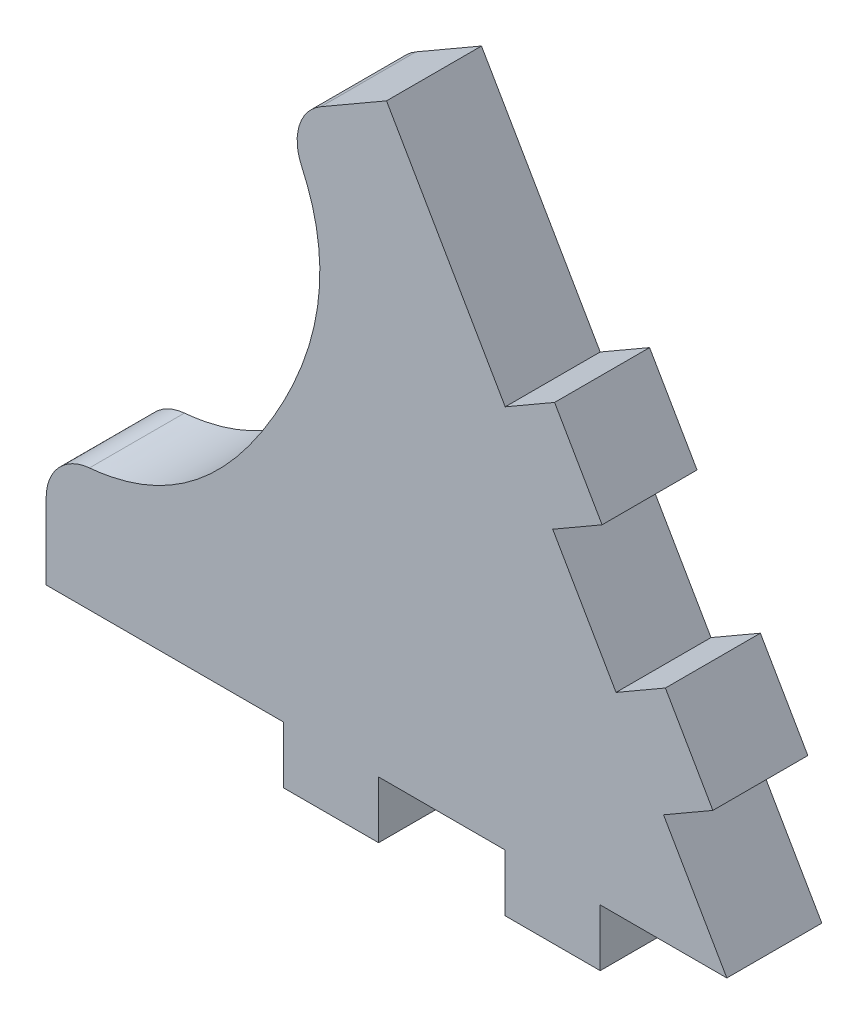
ISO-10303-21;
HEADER;
FILE_DESCRIPTION(('STEP AP214'),'2;1');
FILE_NAME('part.step','',(''),(''),'','','');
FILE_SCHEMA(('AUTOMOTIVE_DESIGN { 1 0 10303 214 1 1 1 1 }'));
ENDSEC;
DATA;
#1=APPLICATION_CONTEXT('core data for automotive mechanical design processes');
#2=APPLICATION_PROTOCOL_DEFINITION('international standard','automotive_design',2000,#1);
#3=PRODUCT_CONTEXT('',#1,'mechanical');
#4=PRODUCT('Part','Part','',(#3));
#5=PRODUCT_RELATED_PRODUCT_CATEGORY('part','',(#4));
#6=PRODUCT_DEFINITION_FORMATION('','',#4);
#7=PRODUCT_DEFINITION_CONTEXT('part definition',#1,'design');
#8=PRODUCT_DEFINITION('design','',#6,#7);
#9=PRODUCT_DEFINITION_SHAPE('','',#8);
#10=(LENGTH_UNIT() NAMED_UNIT(*) SI_UNIT(.MILLI.,.METRE.));
#11=(NAMED_UNIT(*) PLANE_ANGLE_UNIT() SI_UNIT($,.RADIAN.));
#12=(NAMED_UNIT(*) SI_UNIT($,.STERADIAN.) SOLID_ANGLE_UNIT());
#13=UNCERTAINTY_MEASURE_WITH_UNIT(LENGTH_MEASURE(1.E-05),#10,'distance_accuracy_value','');
#14=(GEOMETRIC_REPRESENTATION_CONTEXT(3) GLOBAL_UNCERTAINTY_ASSIGNED_CONTEXT((#13)) GLOBAL_UNIT_ASSIGNED_CONTEXT((#10,
#11,#12)) REPRESENTATION_CONTEXT('',''));
#15=CARTESIAN_POINT('',(0.,0.,0.));
#16=DIRECTION('',(0.,0.,1.));
#17=DIRECTION('',(1.,0.,0.));
#18=AXIS2_PLACEMENT_3D('',#15,#16,#17);
#19=CARTESIAN_POINT('',(46.66666666,-5.99999999999635,10.));
#20=DIRECTION('',(0.,1.,0.));
#21=DIRECTION('',(0.,0.,1.));
#22=AXIS2_PLACEMENT_3D('',#19,#20,#21);
#23=PLANE('',#22);
#24=DIRECTION('',(1.,0.,0.));
#25=VECTOR('',#24,1.);
#26=CARTESIAN_POINT('',(46.66666666,-5.99999999999635,0.));
#27=LINE('',#26,#25);
#28=CARTESIAN_POINT('',(36.66666666,-5.99999999999635,0.));
#29=VERTEX_POINT('',#28);
#30=CARTESIAN_POINT('',(46.66666666,-5.99999999999635,0.));
#31=VERTEX_POINT('',#30);
#32=EDGE_CURVE('E216',#29,#31,#27,.T.);
#33=ORIENTED_EDGE('',*,*,#32,.T.);
#34=DIRECTION('',(0.,0.,-1.));
#35=VECTOR('',#34,1.);
#36=CARTESIAN_POINT('',(46.66666666,-5.99999999999635,10.));
#37=LINE('',#36,#35);
#38=CARTESIAN_POINT('',(46.66666666,-5.99999999999635,10.));
#39=VERTEX_POINT('',#38);
#40=EDGE_CURVE('E197',#39,#31,#37,.T.);
#41=ORIENTED_EDGE('',*,*,#40,.F.);
#42=DIRECTION('',(1.,0.,0.));
#43=VECTOR('',#42,1.);
#44=CARTESIAN_POINT('',(46.66666666,-5.99999999999635,10.));
#45=LINE('',#44,#43);
#46=CARTESIAN_POINT('',(36.66666666,-5.99999999999635,10.));
#47=VERTEX_POINT('',#46);
#48=EDGE_CURVE('E203',#47,#39,#45,.T.);
#49=ORIENTED_EDGE('',*,*,#48,.F.);
#50=DIRECTION('',(0.,0.,-1.));
#51=VECTOR('',#50,1.);
#52=CARTESIAN_POINT('',(36.66666666,-5.99999999999635,10.));
#53=LINE('',#52,#51);
#54=EDGE_CURVE('E280',#47,#29,#53,.T.);
#55=ORIENTED_EDGE('',*,*,#54,.T.);
#56=EDGE_LOOP('',(#33,#41,#49,#55));
#57=FACE_BOUND('',#56,.T.);
#58=ADVANCED_FACE('F32',(#57),#23,.F.);
#59=CARTESIAN_POINT('',(46.66666666,3.64118457607532E-12,10.));
#60=DIRECTION('',(-1.,0.,0.));
#61=DIRECTION('',(0.,-1.,0.));
#62=AXIS2_PLACEMENT_3D('',#59,#60,#61);
#63=PLANE('',#62);
#64=DIRECTION('',(0.,1.,0.));
#65=VECTOR('',#64,1.);
#66=CARTESIAN_POINT('',(46.66666666,3.64118457607532E-12,0.));
#67=LINE('',#66,#65);
#68=CARTESIAN_POINT('',(46.66666666,3.64118457607532E-12,0.));
#69=VERTEX_POINT('',#68);
#70=EDGE_CURVE('E346',#31,#69,#67,.T.);
#71=ORIENTED_EDGE('',*,*,#70,.T.);
#72=DIRECTION('',(0.,0.,-1.));
#73=VECTOR('',#72,1.);
#74=CARTESIAN_POINT('',(46.66666666,3.64118457607532E-12,10.));
#75=LINE('',#74,#73);
#76=CARTESIAN_POINT('',(46.66666666,3.64118457607532E-12,10.));
#77=VERTEX_POINT('',#76);
#78=EDGE_CURVE('E200',#77,#69,#75,.T.);
#79=ORIENTED_EDGE('',*,*,#78,.F.);
#80=DIRECTION('',(0.,1.,0.));
#81=VECTOR('',#80,1.);
#82=CARTESIAN_POINT('',(46.66666666,3.64118457607532E-12,10.));
#83=LINE('',#82,#81);
#84=EDGE_CURVE('E193',#39,#77,#83,.T.);
#85=ORIENTED_EDGE('',*,*,#84,.F.);
#86=ORIENTED_EDGE('',*,*,#40,.T.);
#87=EDGE_LOOP('',(#71,#79,#85,#86));
#88=FACE_BOUND('',#87,.T.);
#89=ADVANCED_FACE('F195',(#88),#63,.F.);
#90=CARTESIAN_POINT('',(59.99999999,1.0184263053034E-12,10.));
#91=DIRECTION('',(1.96706870357071E-13,1.,0.));
#92=DIRECTION('',(-1.,1.96706870357071E-13,0.));
#93=AXIS2_PLACEMENT_3D('',#90,#91,#92);
#94=PLANE('',#93);
#95=DIRECTION('',(1.,-1.96706870357071E-13,0.));
#96=VECTOR('',#95,1.);
#97=CARTESIAN_POINT('',(59.99999999,1.0184263053034E-12,0.));
#98=LINE('',#97,#96);
#99=CARTESIAN_POINT('',(59.99999999,1.0184263053034E-12,0.));
#100=VERTEX_POINT('',#99);
#101=EDGE_CURVE('E340',#69,#100,#98,.T.);
#102=ORIENTED_EDGE('',*,*,#101,.T.);
#103=DIRECTION('',(0.,0.,-1.));
#104=VECTOR('',#103,1.);
#105=CARTESIAN_POINT('',(59.99999999,1.0184263053034E-12,10.));
#106=LINE('',#105,#104);
#107=CARTESIAN_POINT('',(59.99999999,1.0184263053034E-12,10.));
#108=VERTEX_POINT('',#107);
#109=EDGE_CURVE('E222',#108,#100,#106,.T.);
#110=ORIENTED_EDGE('',*,*,#109,.F.);
#111=DIRECTION('',(1.,-1.96706870357071E-13,0.));
#112=VECTOR('',#111,1.);
#113=CARTESIAN_POINT('',(59.99999999,1.0184263053034E-12,10.));
#114=LINE('',#113,#112);
#115=EDGE_CURVE('E202',#77,#108,#114,.T.);
#116=ORIENTED_EDGE('',*,*,#115,.F.);
#117=ORIENTED_EDGE('',*,*,#78,.T.);
#118=EDGE_LOOP('',(#102,#110,#116,#117));
#119=FACE_BOUND('',#118,.T.);
#120=ADVANCED_FACE('F427',(#119),#94,.F.);
#121=CARTESIAN_POINT('',(59.99999999,1.0184263053034E-12,10.));
#122=DIRECTION('',(-0.866025403784341,-0.500000000000169,0.));
#123=DIRECTION('',(0.500000000000169,-0.866025403784341,0.));
#124=AXIS2_PLACEMENT_3D('',#121,#122,#123);
#125=PLANE('',#124);
#126=DIRECTION('',(-0.500000000000169,0.866025403784341,0.));
#127=VECTOR('',#126,1.);
#128=CARTESIAN_POINT('',(59.99999999,1.0184263053034E-12,0.));
#129=LINE('',#128,#127);
#130=CARTESIAN_POINT('',(53.3333333249978,11.5470053809055,0.));
#131=VERTEX_POINT('',#130);
#132=EDGE_CURVE('E335',#100,#131,#129,.T.);
#133=ORIENTED_EDGE('',*,*,#132,.T.);
#134=DIRECTION('',(0.,0.,-1.));
#135=VECTOR('',#134,1.);
#136=CARTESIAN_POINT('',(53.3333333249978,11.5470053809055,10.));
#137=LINE('',#136,#135);
#138=CARTESIAN_POINT('',(53.3333333249978,11.5470053809055,10.));
#139=VERTEX_POINT('',#138);
#140=EDGE_CURVE('E326',#139,#131,#137,.T.);
#141=ORIENTED_EDGE('',*,*,#140,.F.);
#142=DIRECTION('',(-0.500000000000169,0.866025403784341,0.));
#143=VECTOR('',#142,1.);
#144=CARTESIAN_POINT('',(59.99999999,1.0184263053034E-12,10.));
#145=LINE('',#144,#143);
#146=EDGE_CURVE('E336',#108,#139,#145,.T.);
#147=ORIENTED_EDGE('',*,*,#146,.F.);
#148=ORIENTED_EDGE('',*,*,#109,.T.);
#149=EDGE_LOOP('',(#133,#141,#147,#148));
#150=FACE_BOUND('',#149,.T.);
#151=ADVANCED_FACE('F333',(#150),#125,.F.);
#152=CARTESIAN_POINT('',(53.3333333249978,11.5470053809055,10.));
#153=DIRECTION('',(-0.499999999999998,0.86602540378444,0.));
#154=DIRECTION('',(-0.86602540378444,-0.499999999999998,0.));
#155=AXIS2_PLACEMENT_3D('',#152,#153,#154);
#156=PLANE('',#155);
#157=DIRECTION('',(0.86602540378444,0.499999999999998,0.));
#158=VECTOR('',#157,1.);
#159=CARTESIAN_POINT('',(53.3333333249978,11.5470053809055,0.));
#160=LINE('',#159,#158);
#161=CARTESIAN_POINT('',(58.5294857477044,14.5470053809055,0.));
#162=VERTEX_POINT('',#161);
#163=EDGE_CURVE('E342',#131,#162,#160,.T.);
#164=ORIENTED_EDGE('',*,*,#163,.T.);
#165=DIRECTION('',(0.,0.,-1.));
#166=VECTOR('',#165,1.);
#167=CARTESIAN_POINT('',(58.5294857477044,14.5470053809055,10.));
#168=LINE('',#167,#166);
#169=CARTESIAN_POINT('',(58.5294857477044,14.5470053809055,10.));
#170=VERTEX_POINT('',#169);
#171=EDGE_CURVE('E323',#170,#162,#168,.T.);
#172=ORIENTED_EDGE('',*,*,#171,.F.);
#173=DIRECTION('',(0.86602540378444,0.499999999999998,0.));
#174=VECTOR('',#173,1.);
#175=CARTESIAN_POINT('',(53.3333333249978,11.5470053809055,10.));
#176=LINE('',#175,#174);
#177=EDGE_CURVE('E464',#139,#170,#176,.T.);
#178=ORIENTED_EDGE('',*,*,#177,.F.);
#179=ORIENTED_EDGE('',*,*,#140,.T.);
#180=EDGE_LOOP('',(#164,#172,#178,#179));
#181=FACE_BOUND('',#180,.T.);
#182=ADVANCED_FACE('F420',(#181),#156,.F.);
#183=CARTESIAN_POINT('',(58.5294857477044,14.5470053809055,10.));
#184=DIRECTION('',(-0.866025403784439,-0.499999999999999,0.));
#185=DIRECTION('',(0.499999999999999,-0.866025403784439,0.));
#186=AXIS2_PLACEMENT_3D('',#183,#184,#185);
#187=PLANE('',#186);
#188=DIRECTION('',(-0.499999999999999,0.866025403784439,0.));
#189=VECTOR('',#188,1.);
#190=CARTESIAN_POINT('',(58.5294857477044,14.5470053809055,0.));
#191=LINE('',#190,#189);
#192=CARTESIAN_POINT('',(53.5294857477044,23.2072594187499,0.));
#193=VERTEX_POINT('',#192);
#194=EDGE_CURVE('E344',#162,#193,#191,.T.);
#195=ORIENTED_EDGE('',*,*,#194,.T.);
#196=DIRECTION('',(0.,0.,-1.));
#197=VECTOR('',#196,1.);
#198=CARTESIAN_POINT('',(53.5294857477044,23.2072594187499,10.));
#199=LINE('',#198,#197);
#200=CARTESIAN_POINT('',(53.5294857477044,23.2072594187499,10.));
#201=VERTEX_POINT('',#200);
#202=EDGE_CURVE('E320',#201,#193,#199,.T.);
#203=ORIENTED_EDGE('',*,*,#202,.F.);
#204=DIRECTION('',(-0.499999999999999,0.866025403784439,0.));
#205=VECTOR('',#204,1.);
#206=CARTESIAN_POINT('',(58.5294857477044,14.5470053809055,10.));
#207=LINE('',#206,#205);
#208=EDGE_CURVE('E468',#170,#201,#207,.T.);
#209=ORIENTED_EDGE('',*,*,#208,.F.);
#210=ORIENTED_EDGE('',*,*,#171,.T.);
#211=EDGE_LOOP('',(#195,#203,#209,#210));
#212=FACE_BOUND('',#211,.T.);
#213=ADVANCED_FACE('F416',(#212),#187,.F.);
#214=CARTESIAN_POINT('',(53.5294857477044,23.2072594187499,10.));
#215=DIRECTION('',(0.499999999999998,-0.86602540378444,0.));
#216=DIRECTION('',(0.86602540378444,0.499999999999998,0.));
#217=AXIS2_PLACEMENT_3D('',#214,#215,#216);
#218=PLANE('',#217);
#219=DIRECTION('',(-0.86602540378444,-0.499999999999998,0.));
#220=VECTOR('',#219,1.);
#221=CARTESIAN_POINT('',(53.5294857477044,23.2072594187499,0.));
#222=LINE('',#221,#220);
#223=CARTESIAN_POINT('',(48.3333333249978,20.2072594187499,0.));
#224=VERTEX_POINT('',#223);
#225=EDGE_CURVE('E351',#193,#224,#222,.T.);
#226=ORIENTED_EDGE('',*,*,#225,.T.);
#227=DIRECTION('',(0.,0.,-1.));
#228=VECTOR('',#227,1.);
#229=CARTESIAN_POINT('',(48.3333333249978,20.2072594187499,10.));
#230=LINE('',#229,#228);
#231=CARTESIAN_POINT('',(48.3333333249978,20.2072594187499,10.));
#232=VERTEX_POINT('',#231);
#233=EDGE_CURVE('E317',#232,#224,#230,.T.);
#234=ORIENTED_EDGE('',*,*,#233,.F.);
#235=DIRECTION('',(-0.86602540378444,-0.499999999999998,0.));
#236=VECTOR('',#235,1.);
#237=CARTESIAN_POINT('',(53.5294857477044,23.2072594187499,10.));
#238=LINE('',#237,#236);
#239=EDGE_CURVE('E470',#201,#232,#238,.T.);
#240=ORIENTED_EDGE('',*,*,#239,.F.);
#241=ORIENTED_EDGE('',*,*,#202,.T.);
#242=EDGE_LOOP('',(#226,#234,#240,#241));
#243=FACE_BOUND('',#242,.T.);
#244=ADVANCED_FACE('F412',(#243),#218,.F.);
#245=CARTESIAN_POINT('',(48.3333333249978,20.2072594187499,10.));
#246=DIRECTION('',(-0.86602540378444,-0.499999999999998,0.));
#247=DIRECTION('',(0.499999999999998,-0.86602540378444,0.));
#248=AXIS2_PLACEMENT_3D('',#245,#246,#247);
#249=PLANE('',#248);
#250=DIRECTION('',(-0.499999999999998,0.86602540378444,0.));
#251=VECTOR('',#250,1.);
#252=CARTESIAN_POINT('',(48.3333333249978,20.2072594187499,0.));
#253=LINE('',#252,#251);
#254=CARTESIAN_POINT('',(41.6666666599978,31.7542647996557,0.));
#255=VERTEX_POINT('',#254);
#256=EDGE_CURVE('E353',#224,#255,#253,.T.);
#257=ORIENTED_EDGE('',*,*,#256,.T.);
#258=DIRECTION('',(0.,0.,-1.));
#259=VECTOR('',#258,1.);
#260=CARTESIAN_POINT('',(41.6666666599978,31.7542647996557,10.));
#261=LINE('',#260,#259);
#262=CARTESIAN_POINT('',(41.6666666599978,31.7542647996557,10.));
#263=VERTEX_POINT('',#262);
#264=EDGE_CURVE('E314',#263,#255,#261,.T.);
#265=ORIENTED_EDGE('',*,*,#264,.F.);
#266=DIRECTION('',(-0.499999999999998,0.86602540378444,0.));
#267=VECTOR('',#266,1.);
#268=CARTESIAN_POINT('',(48.3333333249978,20.2072594187499,10.));
#269=LINE('',#268,#267);
#270=EDGE_CURVE('E472',#232,#263,#269,.T.);
#271=ORIENTED_EDGE('',*,*,#270,.F.);
#272=ORIENTED_EDGE('',*,*,#233,.T.);
#273=EDGE_LOOP('',(#257,#265,#271,#272));
#274=FACE_BOUND('',#273,.T.);
#275=ADVANCED_FACE('F408',(#274),#249,.F.);
#276=CARTESIAN_POINT('',(41.6666666599978,31.7542647996557,10.));
#277=DIRECTION('',(-0.499999999999999,0.866025403784439,0.));
#278=DIRECTION('',(-0.866025403784439,-0.499999999999999,0.));
#279=AXIS2_PLACEMENT_3D('',#276,#277,#278);
#280=PLANE('',#279);
#281=DIRECTION('',(0.866025403784439,0.499999999999999,0.));
#282=VECTOR('',#281,1.);
#283=CARTESIAN_POINT('',(41.6666666599978,31.7542647996557,0.));
#284=LINE('',#283,#282);
#285=CARTESIAN_POINT('',(46.8628190827044,34.7542647996556,0.));
#286=VERTEX_POINT('',#285);
#287=EDGE_CURVE('E355',#255,#286,#284,.T.);
#288=ORIENTED_EDGE('',*,*,#287,.T.);
#289=DIRECTION('',(0.,0.,-1.));
#290=VECTOR('',#289,1.);
#291=CARTESIAN_POINT('',(46.8628190827044,34.7542647996556,10.));
#292=LINE('',#291,#290);
#293=CARTESIAN_POINT('',(46.8628190827044,34.7542647996556,10.));
#294=VERTEX_POINT('',#293);
#295=EDGE_CURVE('E311',#294,#286,#292,.T.);
#296=ORIENTED_EDGE('',*,*,#295,.F.);
#297=DIRECTION('',(0.866025403784439,0.499999999999999,0.));
#298=VECTOR('',#297,1.);
#299=CARTESIAN_POINT('',(41.6666666599978,31.7542647996557,10.));
#300=LINE('',#299,#298);
#301=EDGE_CURVE('E474',#263,#294,#300,.T.);
#302=ORIENTED_EDGE('',*,*,#301,.F.);
#303=ORIENTED_EDGE('',*,*,#264,.T.);
#304=EDGE_LOOP('',(#288,#296,#302,#303));
#305=FACE_BOUND('',#304,.T.);
#306=ADVANCED_FACE('F404',(#305),#280,.F.);
#307=CARTESIAN_POINT('',(46.8628190827044,34.7542647996556,10.));
#308=DIRECTION('',(-0.86602540378444,-0.499999999999998,0.));
#309=DIRECTION('',(0.499999999999998,-0.86602540378444,0.));
#310=AXIS2_PLACEMENT_3D('',#307,#308,#309);
#311=PLANE('',#310);
#312=DIRECTION('',(-0.499999999999999,0.86602540378444,0.));
#313=VECTOR('',#312,1.);
#314=CARTESIAN_POINT('',(46.8628190827044,34.7542647996556,0.));
#315=LINE('',#314,#313);
#316=CARTESIAN_POINT('',(41.8628190827045,43.4145188375,0.));
#317=VERTEX_POINT('',#316);
#318=EDGE_CURVE('E357',#286,#317,#315,.T.);
#319=ORIENTED_EDGE('',*,*,#318,.T.);
#320=DIRECTION('',(0.,0.,-1.));
#321=VECTOR('',#320,1.);
#322=CARTESIAN_POINT('',(41.8628190827045,43.4145188375,10.));
#323=LINE('',#322,#321);
#324=CARTESIAN_POINT('',(41.8628190827045,43.4145188375,10.));
#325=VERTEX_POINT('',#324);
#326=EDGE_CURVE('E308',#325,#317,#323,.T.);
#327=ORIENTED_EDGE('',*,*,#326,.F.);
#328=DIRECTION('',(-0.499999999999999,0.86602540378444,0.));
#329=VECTOR('',#328,1.);
#330=CARTESIAN_POINT('',(46.8628190827044,34.7542647996556,10.));
#331=LINE('',#330,#329);
#332=EDGE_CURVE('E476',#294,#325,#331,.T.);
#333=ORIENTED_EDGE('',*,*,#332,.F.);
#334=ORIENTED_EDGE('',*,*,#295,.T.);
#335=EDGE_LOOP('',(#319,#327,#333,#334));
#336=FACE_BOUND('',#335,.T.);
#337=ADVANCED_FACE('F400',(#336),#311,.F.);
#338=CARTESIAN_POINT('',(41.8628190827045,43.4145188375,10.));
#339=DIRECTION('',(0.499999999999998,-0.86602540378444,0.));
#340=DIRECTION('',(0.86602540378444,0.499999999999998,0.));
#341=AXIS2_PLACEMENT_3D('',#338,#339,#340);
#342=PLANE('',#341);
#343=DIRECTION('',(-0.86602540378444,-0.499999999999998,0.));
#344=VECTOR('',#343,1.);
#345=CARTESIAN_POINT('',(41.8628190827045,43.4145188375,0.));
#346=LINE('',#345,#344);
#347=CARTESIAN_POINT('',(36.6666666599978,40.4145188375001,0.));
#348=VERTEX_POINT('',#347);
#349=EDGE_CURVE('E359',#317,#348,#346,.T.);
#350=ORIENTED_EDGE('',*,*,#349,.T.);
#351=DIRECTION('',(0.,0.,-1.));
#352=VECTOR('',#351,1.);
#353=CARTESIAN_POINT('',(36.6666666599978,40.4145188375001,10.));
#354=LINE('',#353,#352);
#355=CARTESIAN_POINT('',(36.6666666599978,40.4145188375001,10.));
#356=VERTEX_POINT('',#355);
#357=EDGE_CURVE('E305',#356,#348,#354,.T.);
#358=ORIENTED_EDGE('',*,*,#357,.F.);
#359=DIRECTION('',(-0.86602540378444,-0.499999999999998,0.));
#360=VECTOR('',#359,1.);
#361=CARTESIAN_POINT('',(41.8628190827045,43.4145188375,10.));
#362=LINE('',#361,#360);
#363=EDGE_CURVE('E373',#325,#356,#362,.T.);
#364=ORIENTED_EDGE('',*,*,#363,.F.);
#365=ORIENTED_EDGE('',*,*,#326,.T.);
#366=EDGE_LOOP('',(#350,#358,#364,#365));
#367=FACE_BOUND('',#366,.T.);
#368=ADVANCED_FACE('F397',(#367),#342,.F.);
#369=CARTESIAN_POINT('',(36.6666666599978,40.4145188375001,10.));
#370=DIRECTION('',(-0.86602540378444,-0.499999999999998,0.));
#371=DIRECTION('',(0.499999999999998,-0.86602540378444,0.));
#372=AXIS2_PLACEMENT_3D('',#369,#370,#371);
#373=PLANE('',#372);
#374=DIRECTION('',(-0.499999999999998,0.86602540378444,0.));
#375=VECTOR('',#374,1.);
#376=CARTESIAN_POINT('',(36.6666666599978,40.4145188375001,0.));
#377=LINE('',#376,#375);
#378=CARTESIAN_POINT('',(24.1666666599979,62.065153932111,0.));
#379=VERTEX_POINT('',#378);
#380=EDGE_CURVE('E254',#348,#379,#377,.T.);
#381=ORIENTED_EDGE('',*,*,#380,.T.);
#382=DIRECTION('',(0.,0.,-1.));
#383=VECTOR('',#382,1.);
#384=CARTESIAN_POINT('',(24.1666666599979,62.065153932111,10.));
#385=LINE('',#384,#383);
#386=CARTESIAN_POINT('',(24.1666666599979,62.065153932111,10.));
#387=VERTEX_POINT('',#386);
#388=EDGE_CURVE('E302',#387,#379,#385,.T.);
#389=ORIENTED_EDGE('',*,*,#388,.F.);
#390=DIRECTION('',(-0.499999999999998,0.86602540378444,0.));
#391=VECTOR('',#390,1.);
#392=CARTESIAN_POINT('',(36.6666666599978,40.4145188375001,10.));
#393=LINE('',#392,#391);
#394=EDGE_CURVE('E369',#356,#387,#393,.T.);
#395=ORIENTED_EDGE('',*,*,#394,.F.);
#396=ORIENTED_EDGE('',*,*,#357,.T.);
#397=EDGE_LOOP('',(#381,#389,#395,#396));
#398=FACE_BOUND('',#397,.T.);
#399=ADVANCED_FACE('F363',(#398),#373,.F.);
#400=CARTESIAN_POINT('',(24.1666666599979,62.065153932111,10.));
#401=DIRECTION('',(0.499999999999998,-0.86602540378444,0.));
#402=DIRECTION('',(0.86602540378444,0.499999999999998,0.));
#403=AXIS2_PLACEMENT_3D('',#400,#401,#402);
#404=PLANE('',#403);
#405=DIRECTION('',(-0.86602540378444,-0.499999999999998,0.));
#406=VECTOR('',#405,1.);
#407=CARTESIAN_POINT('',(24.1666666599979,62.065153932111,0.));
#408=LINE('',#407,#406);
#409=CARTESIAN_POINT('',(17.2590670866979,58.0770494590122,0.));
#410=VERTEX_POINT('',#409);
#411=EDGE_CURVE('E250',#379,#410,#408,.T.);
#412=ORIENTED_EDGE('',*,*,#411,.T.);
#413=DIRECTION('',(0.,0.,-1.));
#414=VECTOR('',#413,1.);
#415=CARTESIAN_POINT('',(17.2590670866979,58.0770494590122,10.));
#416=LINE('',#415,#414);
#417=CARTESIAN_POINT('',(17.2590670866979,58.0770494590122,10.));
#418=VERTEX_POINT('',#417);
#419=EDGE_CURVE('E11',#410,#418,#416,.F.);
#420=ORIENTED_EDGE('',*,*,#419,.T.);
#421=DIRECTION('',(-0.86602540378444,-0.499999999999998,0.));
#422=VECTOR('',#421,1.);
#423=CARTESIAN_POINT('',(24.1666666599979,62.065153932111,10.));
#424=LINE('',#423,#422);
#425=EDGE_CURVE('E368',#387,#418,#424,.T.);
#426=ORIENTED_EDGE('',*,*,#425,.F.);
#427=ORIENTED_EDGE('',*,*,#388,.T.);
#428=EDGE_LOOP('',(#412,#420,#426,#427));
#429=FACE_BOUND('',#428,.T.);
#430=ADVANCED_FACE('F367',(#429),#404,.F.);
#431=CARTESIAN_POINT('',(12.9083364108002,55.5651539321111,10.));
#432=CARTESIAN_POINT('',(18.7924563491927,47.4128398780908,10.));
#433=CARTESIAN_POINT('',(18.5015234532931,38.1225302017197,10.));
#434=CARTESIAN_POINT('',(12.3686027818559,27.5000000000011,10.));
#435=B_SPLINE_CURVE_WITH_KNOTS('',3,(#431,#432,#433,#434),.UNSPECIFIED.,.F.,.F.,(4,4),(0.,1.),.UNSPECIFIED.);
#436=DIRECTION('',(0.,0.,-1.));
#437=VECTOR('',#436,1.);
#438=SURFACE_OF_LINEAR_EXTRUSION('',#435,#437);
#439=CARTESIAN_POINT('',(15.2241348473369,51.6411234030485,10.));
#440=VERTEX_POINT('',#439);
#441=CARTESIAN_POINT('',(12.3686027818559,27.5000000000011,10.));
#442=VERTEX_POINT('',#441);
#443=EDGE_CURVE('E241',#440,#442,#435,.T.);
#444=ORIENTED_EDGE('',*,*,#443,.F.);
#445=DIRECTION('',(0.,0.,-1.));
#446=VECTOR('',#445,1.);
#447=CARTESIAN_POINT('',(15.2241348473369,51.6411234030485,10.));
#448=LINE('',#447,#446);
#449=CARTESIAN_POINT('',(15.2241348473369,51.6411234030485,0.));
#450=VERTEX_POINT('',#449);
#451=EDGE_CURVE('E40',#440,#450,#448,.T.);
#452=ORIENTED_EDGE('',*,*,#451,.T.);
#453=CARTESIAN_POINT('',(12.9083364108002,55.5651539321111,0.));
#454=CARTESIAN_POINT('',(18.7924563491927,47.4128398780908,0.));
#455=CARTESIAN_POINT('',(18.5015234532931,38.1225302017197,0.));
#456=CARTESIAN_POINT('',(12.3686027818559,27.5000000000011,0.));
#457=B_SPLINE_CURVE_WITH_KNOTS('',3,(#453,#454,#455,#456),.UNSPECIFIED.,.F.,.F.,(4,4),(0.,1.),.UNSPECIFIED.);
#458=CARTESIAN_POINT('',(12.3686027818559,27.5000000000011,0.));
#459=VERTEX_POINT('',#458);
#460=EDGE_CURVE('E239',#450,#459,#457,.T.);
#461=ORIENTED_EDGE('',*,*,#460,.T.);
#462=DIRECTION('',(0.,0.,-1.));
#463=VECTOR('',#462,1.);
#464=CARTESIAN_POINT('',(12.3686027818559,27.5000000000011,10.));
#465=LINE('',#464,#463);
#466=EDGE_CURVE('E300',#442,#459,#465,.T.);
#467=ORIENTED_EDGE('',*,*,#466,.F.);
#468=EDGE_LOOP('',(#444,#452,#461,#467));
#469=FACE_BOUND('',#468,.T.);
#470=ADVANCED_FACE('F237',(#469),#438,.F.);
#471=CARTESIAN_POINT('',(12.3686027818559,27.5000000000011,10.));
#472=CARTESIAN_POINT('',(6.23568211041872,16.8774697982824,10.));
#473=CARTESIAN_POINT('',(-1.66449563039327,11.9803596814513,10.));
#474=CARTESIAN_POINT('',(-11.66666667,13.0000000000036,10.));
#475=B_SPLINE_CURVE_WITH_KNOTS('',3,(#471,#472,#473,#474),.UNSPECIFIED.,.F.,.F.,(4,4),(0.,1.),.UNSPECIFIED.);
#476=DIRECTION('',(0.,0.,-1.));
#477=VECTOR('',#476,1.);
#478=SURFACE_OF_LINEAR_EXTRUSION('',#475,#477);
#479=CARTESIAN_POINT('',(12.3686027818559,27.5000000000011,0.));
#480=CARTESIAN_POINT('',(6.23568211041872,16.8774697982824,0.));
#481=CARTESIAN_POINT('',(-1.66449563039327,11.9803596814513,0.));
#482=CARTESIAN_POINT('',(-11.66666667,13.0000000000036,0.));
#483=B_SPLINE_CURVE_WITH_KNOTS('',3,(#479,#480,#481,#482),.UNSPECIFIED.,.F.,.F.,(4,4),(0.,1.),.UNSPECIFIED.);
#484=CARTESIAN_POINT('',(-7.11045732833768,12.9564749884498,0.));
#485=VERTEX_POINT('',#484);
#486=EDGE_CURVE('E249',#459,#485,#483,.T.);
#487=ORIENTED_EDGE('',*,*,#486,.T.);
#488=DIRECTION('',(0.,0.,-1.));
#489=VECTOR('',#488,1.);
#490=CARTESIAN_POINT('',(-7.11045732833768,12.9564749884498,0.));
#491=LINE('',#490,#489);
#492=CARTESIAN_POINT('',(-7.11045732833768,12.9564749884498,10.));
#493=VERTEX_POINT('',#492);
#494=EDGE_CURVE('E229',#485,#493,#491,.F.);
#495=ORIENTED_EDGE('',*,*,#494,.T.);
#496=EDGE_CURVE('E371',#442,#493,#475,.T.);
#497=ORIENTED_EDGE('',*,*,#496,.F.);
#498=ORIENTED_EDGE('',*,*,#466,.T.);
#499=EDGE_LOOP('',(#487,#495,#497,#498));
#500=FACE_BOUND('',#499,.T.);
#501=ADVANCED_FACE('F391',(#500),#478,.F.);
#502=CARTESIAN_POINT('',(-11.6666666699999,3.54577478489659E-12,10.));
#503=DIRECTION('',(1.,0.,0.));
#504=DIRECTION('',(0.,1.,0.));
#505=AXIS2_PLACEMENT_3D('',#502,#503,#504);
#506=PLANE('',#505);
#507=DIRECTION('',(0.,-1.,0.));
#508=VECTOR('',#507,1.);
#509=CARTESIAN_POINT('',(-11.6666666699999,3.54577478489659E-12,10.));
#510=LINE('',#509,#508);
#511=CARTESIAN_POINT('',(-11.6666666699999,7.97620894620139,10.));
#512=VERTEX_POINT('',#511);
#513=CARTESIAN_POINT('',(-11.6666666699999,3.54577478489659E-12,10.));
#514=VERTEX_POINT('',#513);
#515=EDGE_CURVE('E445',#512,#514,#510,.T.);
#516=ORIENTED_EDGE('',*,*,#515,.F.);
#517=DIRECTION('',(0.,0.,-1.));
#518=VECTOR('',#517,1.);
#519=CARTESIAN_POINT('',(-11.6666666699999,7.97620894620139,10.));
#520=LINE('',#519,#518);
#521=CARTESIAN_POINT('',(-11.6666666699999,7.97620894620139,0.));
#522=VERTEX_POINT('',#521);
#523=EDGE_CURVE('E217',#512,#522,#520,.T.);
#524=ORIENTED_EDGE('',*,*,#523,.T.);
#525=DIRECTION('',(0.,-1.,0.));
#526=VECTOR('',#525,1.);
#527=CARTESIAN_POINT('',(-11.6666666699999,3.54577478489659E-12,0.));
#528=LINE('',#527,#526);
#529=CARTESIAN_POINT('',(-11.6666666699999,3.54577478489659E-12,0.));
#530=VERTEX_POINT('',#529);
#531=EDGE_CURVE('E252',#522,#530,#528,.T.);
#532=ORIENTED_EDGE('',*,*,#531,.T.);
#533=DIRECTION('',(0.,0.,-1.));
#534=VECTOR('',#533,1.);
#535=CARTESIAN_POINT('',(-11.6666666699999,3.54577478489659E-12,10.));
#536=LINE('',#535,#534);
#537=EDGE_CURVE('E297',#514,#530,#536,.T.);
#538=ORIENTED_EDGE('',*,*,#537,.F.);
#539=EDGE_LOOP('',(#516,#524,#532,#538));
#540=FACE_BOUND('',#539,.T.);
#541=ADVANCED_FACE('F449',(#540),#506,.F.);
#542=CARTESIAN_POINT('',(13.33333333,3.64291929955129E-12,10.));
#543=DIRECTION('',(0.,1.,0.));
#544=DIRECTION('',(-1.,0.,0.));
#545=AXIS2_PLACEMENT_3D('',#542,#543,#544);
#546=PLANE('',#545);
#547=DIRECTION('',(1.,0.,0.));
#548=VECTOR('',#547,1.);
#549=CARTESIAN_POINT('',(13.33333333,3.64291929955129E-12,0.));
#550=LINE('',#549,#548);
#551=CARTESIAN_POINT('',(13.33333333,3.64291929955129E-12,0.));
#552=VERTEX_POINT('',#551);
#553=EDGE_CURVE('E269',#530,#552,#550,.T.);
#554=ORIENTED_EDGE('',*,*,#553,.T.);
#555=DIRECTION('',(0.,0.,-1.));
#556=VECTOR('',#555,1.);
#557=CARTESIAN_POINT('',(13.33333333,3.64291929955129E-12,10.));
#558=LINE('',#557,#556);
#559=CARTESIAN_POINT('',(13.33333333,3.64291929955129E-12,10.));
#560=VERTEX_POINT('',#559);
#561=EDGE_CURVE('E294',#560,#552,#558,.T.);
#562=ORIENTED_EDGE('',*,*,#561,.F.);
#563=DIRECTION('',(1.,0.,0.));
#564=VECTOR('',#563,1.);
#565=CARTESIAN_POINT('',(13.33333333,3.64291929955129E-12,10.));
#566=LINE('',#565,#564);
#567=EDGE_CURVE('E451',#514,#560,#566,.T.);
#568=ORIENTED_EDGE('',*,*,#567,.F.);
#569=ORIENTED_EDGE('',*,*,#537,.T.);
#570=EDGE_LOOP('',(#554,#562,#568,#569));
#571=FACE_BOUND('',#570,.T.);
#572=ADVANCED_FACE('F520',(#571),#546,.F.);
#573=CARTESIAN_POINT('',(13.33333333,-5.99999999999636,10.));
#574=DIRECTION('',(1.,0.,0.));
#575=DIRECTION('',(0.,1.,0.));
#576=AXIS2_PLACEMENT_3D('',#573,#574,#575);
#577=PLANE('',#576);
#578=DIRECTION('',(0.,-1.,0.));
#579=VECTOR('',#578,1.);
#580=CARTESIAN_POINT('',(13.33333333,-5.99999999999636,0.));
#581=LINE('',#580,#579);
#582=CARTESIAN_POINT('',(13.33333333,-5.99999999999636,0.));
#583=VERTEX_POINT('',#582);
#584=EDGE_CURVE('E271',#552,#583,#581,.T.);
#585=ORIENTED_EDGE('',*,*,#584,.T.);
#586=DIRECTION('',(0.,0.,-1.));
#587=VECTOR('',#586,1.);
#588=CARTESIAN_POINT('',(13.33333333,-5.99999999999636,10.));
#589=LINE('',#588,#587);
#590=CARTESIAN_POINT('',(13.33333333,-5.99999999999636,10.));
#591=VERTEX_POINT('',#590);
#592=EDGE_CURVE('E291',#591,#583,#589,.T.);
#593=ORIENTED_EDGE('',*,*,#592,.F.);
#594=DIRECTION('',(0.,-1.,0.));
#595=VECTOR('',#594,1.);
#596=CARTESIAN_POINT('',(13.33333333,-5.99999999999636,10.));
#597=LINE('',#596,#595);
#598=EDGE_CURVE('E452',#560,#591,#597,.T.);
#599=ORIENTED_EDGE('',*,*,#598,.F.);
#600=ORIENTED_EDGE('',*,*,#561,.T.);
#601=EDGE_LOOP('',(#585,#593,#599,#600));
#602=FACE_BOUND('',#601,.T.);
#603=ADVANCED_FACE('F517',(#602),#577,.F.);
#604=CARTESIAN_POINT('',(23.33333333,-5.99999999999633,10.));
#605=DIRECTION('',(0.,1.,0.));
#606=DIRECTION('',(-1.,0.,0.));
#607=AXIS2_PLACEMENT_3D('',#604,#605,#606);
#608=PLANE('',#607);
#609=DIRECTION('',(1.,0.,0.));
#610=VECTOR('',#609,1.);
#611=CARTESIAN_POINT('',(23.33333333,-5.99999999999633,0.));
#612=LINE('',#611,#610);
#613=CARTESIAN_POINT('',(23.33333333,-5.99999999999633,0.));
#614=VERTEX_POINT('',#613);
#615=EDGE_CURVE('E273',#583,#614,#612,.T.);
#616=ORIENTED_EDGE('',*,*,#615,.T.);
#617=DIRECTION('',(0.,0.,-1.));
#618=VECTOR('',#617,1.);
#619=CARTESIAN_POINT('',(23.33333333,-5.99999999999633,10.));
#620=LINE('',#619,#618);
#621=CARTESIAN_POINT('',(23.33333333,-5.99999999999633,10.));
#622=VERTEX_POINT('',#621);
#623=EDGE_CURVE('E288',#622,#614,#620,.T.);
#624=ORIENTED_EDGE('',*,*,#623,.F.);
#625=DIRECTION('',(1.,0.,0.));
#626=VECTOR('',#625,1.);
#627=CARTESIAN_POINT('',(23.33333333,-5.99999999999633,10.));
#628=LINE('',#627,#626);
#629=EDGE_CURVE('E456',#591,#622,#628,.T.);
#630=ORIENTED_EDGE('',*,*,#629,.F.);
#631=ORIENTED_EDGE('',*,*,#592,.T.);
#632=EDGE_LOOP('',(#616,#624,#630,#631));
#633=FACE_BOUND('',#632,.T.);
#634=ADVANCED_FACE('F512',(#633),#608,.F.);
#635=CARTESIAN_POINT('',(23.33333333,3.0739299994309E-12,10.));
#636=DIRECTION('',(-1.,0.,0.));
#637=DIRECTION('',(0.,-1.,0.));
#638=AXIS2_PLACEMENT_3D('',#635,#636,#637);
#639=PLANE('',#638);
#640=DIRECTION('',(0.,1.,0.));
#641=VECTOR('',#640,1.);
#642=CARTESIAN_POINT('',(23.33333333,3.0739299994309E-12,0.));
#643=LINE('',#642,#641);
#644=CARTESIAN_POINT('',(23.33333333,3.0739299994309E-12,0.));
#645=VERTEX_POINT('',#644);
#646=EDGE_CURVE('E275',#614,#645,#643,.T.);
#647=ORIENTED_EDGE('',*,*,#646,.T.);
#648=DIRECTION('',(0.,0.,-1.));
#649=VECTOR('',#648,1.);
#650=CARTESIAN_POINT('',(23.33333333,3.0739299994309E-12,10.));
#651=LINE('',#650,#649);
#652=CARTESIAN_POINT('',(23.33333333,3.0739299994309E-12,10.));
#653=VERTEX_POINT('',#652);
#654=EDGE_CURVE('E285',#653,#645,#651,.T.);
#655=ORIENTED_EDGE('',*,*,#654,.F.);
#656=DIRECTION('',(0.,1.,0.));
#657=VECTOR('',#656,1.);
#658=CARTESIAN_POINT('',(23.33333333,3.0739299994309E-12,10.));
#659=LINE('',#658,#657);
#660=EDGE_CURVE('E458',#622,#653,#659,.T.);
#661=ORIENTED_EDGE('',*,*,#660,.F.);
#662=ORIENTED_EDGE('',*,*,#623,.T.);
#663=EDGE_LOOP('',(#647,#655,#661,#662));
#664=FACE_BOUND('',#663,.T.);
#665=ADVANCED_FACE('F506',(#664),#639,.F.);
#666=CARTESIAN_POINT('',(36.66666666,3.63598040564739E-12,10.));
#667=DIRECTION('',(0.,1.,0.));
#668=DIRECTION('',(-1.,0.,0.));
#669=AXIS2_PLACEMENT_3D('',#666,#667,#668);
#670=PLANE('',#669);
#671=DIRECTION('',(1.,0.,0.));
#672=VECTOR('',#671,1.);
#673=CARTESIAN_POINT('',(36.66666666,3.63598040564739E-12,0.));
#674=LINE('',#673,#672);
#675=CARTESIAN_POINT('',(36.66666666,3.63598040564739E-12,0.));
#676=VERTEX_POINT('',#675);
#677=EDGE_CURVE('E277',#645,#676,#674,.T.);
#678=ORIENTED_EDGE('',*,*,#677,.T.);
#679=DIRECTION('',(0.,0.,-1.));
#680=VECTOR('',#679,1.);
#681=CARTESIAN_POINT('',(36.66666666,3.63598040564739E-12,10.));
#682=LINE('',#681,#680);
#683=CARTESIAN_POINT('',(36.66666666,3.63598040564739E-12,10.));
#684=VERTEX_POINT('',#683);
#685=EDGE_CURVE('E282',#684,#676,#682,.T.);
#686=ORIENTED_EDGE('',*,*,#685,.F.);
#687=DIRECTION('',(1.,0.,0.));
#688=VECTOR('',#687,1.);
#689=CARTESIAN_POINT('',(36.66666666,3.63598040564739E-12,10.));
#690=LINE('',#689,#688);
#691=EDGE_CURVE('E460',#653,#684,#690,.T.);
#692=ORIENTED_EDGE('',*,*,#691,.F.);
#693=ORIENTED_EDGE('',*,*,#654,.T.);
#694=EDGE_LOOP('',(#678,#686,#692,#693));
#695=FACE_BOUND('',#694,.T.);
#696=ADVANCED_FACE('F502',(#695),#670,.F.);
#697=CARTESIAN_POINT('',(36.66666666,-5.99999999999635,10.));
#698=DIRECTION('',(1.,0.,0.));
#699=DIRECTION('',(0.,1.,0.));
#700=AXIS2_PLACEMENT_3D('',#697,#698,#699);
#701=PLANE('',#700);
#702=DIRECTION('',(0.,-1.,0.));
#703=VECTOR('',#702,1.);
#704=CARTESIAN_POINT('',(36.66666666,-5.99999999999635,0.));
#705=LINE('',#704,#703);
#706=EDGE_CURVE('E213',#676,#29,#705,.T.);
#707=ORIENTED_EDGE('',*,*,#706,.T.);
#708=ORIENTED_EDGE('',*,*,#54,.F.);
#709=DIRECTION('',(0.,-1.,0.));
#710=VECTOR('',#709,1.);
#711=CARTESIAN_POINT('',(36.66666666,-5.99999999999635,10.));
#712=LINE('',#711,#710);
#713=EDGE_CURVE('E209',#684,#47,#712,.T.);
#714=ORIENTED_EDGE('',*,*,#713,.F.);
#715=ORIENTED_EDGE('',*,*,#685,.T.);
#716=EDGE_LOOP('',(#707,#708,#714,#715));
#717=FACE_BOUND('',#716,.T.);
#718=ADVANCED_FACE('F498',(#717),#701,.F.);
#719=CARTESIAN_POINT('',(1.80193694399154,15.8841860549007,10.));
#720=DIRECTION('',(0.,0.,-1.));
#721=DIRECTION('',(-1.,0.,0.));
#722=AXIS2_PLACEMENT_3D('',#719,#720,#721);
#723=PLANE('',#722);
#724=ORIENTED_EDGE('',*,*,#496,.T.);
#725=CARTESIAN_POINT('',(-6.66666666999994,7.97620894620144,10.));
#726=DIRECTION('',(0.,0.,-1.));
#727=DIRECTION('',(-1.,0.,0.));
#728=AXIS2_PLACEMENT_3D('',#725,#726,#727);
#729=CIRCLE('',#728,5.);
#730=EDGE_CURVE('E232',#493,#512,#729,.F.);
#731=ORIENTED_EDGE('',*,*,#730,.T.);
#732=ORIENTED_EDGE('',*,*,#515,.T.);
#733=ORIENTED_EDGE('',*,*,#567,.T.);
#734=ORIENTED_EDGE('',*,*,#598,.T.);
#735=ORIENTED_EDGE('',*,*,#629,.T.);
#736=ORIENTED_EDGE('',*,*,#660,.T.);
#737=ORIENTED_EDGE('',*,*,#691,.T.);
#738=ORIENTED_EDGE('',*,*,#713,.T.);
#739=ORIENTED_EDGE('',*,*,#48,.T.);
#740=ORIENTED_EDGE('',*,*,#84,.T.);
#741=ORIENTED_EDGE('',*,*,#115,.T.);
#742=ORIENTED_EDGE('',*,*,#146,.T.);
#743=ORIENTED_EDGE('',*,*,#177,.T.);
#744=ORIENTED_EDGE('',*,*,#208,.T.);
#745=ORIENTED_EDGE('',*,*,#239,.T.);
#746=ORIENTED_EDGE('',*,*,#270,.T.);
#747=ORIENTED_EDGE('',*,*,#301,.T.);
#748=ORIENTED_EDGE('',*,*,#332,.T.);
#749=ORIENTED_EDGE('',*,*,#363,.T.);
#750=ORIENTED_EDGE('',*,*,#394,.T.);
#751=ORIENTED_EDGE('',*,*,#425,.T.);
#752=CARTESIAN_POINT('',(19.7590670866979,53.74692244009,10.));
#753=DIRECTION('',(0.,0.,-1.));
#754=DIRECTION('',(-1.,0.,0.));
#755=AXIS2_PLACEMENT_3D('',#752,#753,#754);
#756=CIRCLE('',#755,5.);
#757=EDGE_CURVE('E47',#418,#440,#756,.F.);
#758=ORIENTED_EDGE('',*,*,#757,.T.);
#759=ORIENTED_EDGE('',*,*,#443,.T.);
#760=EDGE_LOOP('',(#724,#731,#732,#733,#734,#735,#736,#737,#738,#739,#740,#741,#742,#743,#744,
#745,#746,#747,#748,#749,#750,#751,#758,#759));
#761=FACE_BOUND('',#760,.T.);
#762=ADVANCED_FACE('F207',(#761),#723,.F.);
#763=CARTESIAN_POINT('',(1.80193694399154,15.8841860549007,0.));
#764=DIRECTION('',(0.,0.,-1.));
#765=DIRECTION('',(-1.,0.,0.));
#766=AXIS2_PLACEMENT_3D('',#763,#764,#765);
#767=PLANE('',#766);
#768=ORIENTED_EDGE('',*,*,#531,.F.);
#769=CARTESIAN_POINT('',(-6.66666666999994,7.97620894620144,0.));
#770=DIRECTION('',(0.,0.,-1.));
#771=DIRECTION('',(-1.,0.,0.));
#772=AXIS2_PLACEMENT_3D('',#769,#770,#771);
#773=CIRCLE('',#772,5.);
#774=EDGE_CURVE('E227',#522,#485,#773,.T.);
#775=ORIENTED_EDGE('',*,*,#774,.T.);
#776=ORIENTED_EDGE('',*,*,#486,.F.);
#777=ORIENTED_EDGE('',*,*,#460,.F.);
#778=CARTESIAN_POINT('',(19.7590670866979,53.74692244009,0.));
#779=DIRECTION('',(0.,0.,-1.));
#780=DIRECTION('',(-1.,0.,0.));
#781=AXIS2_PLACEMENT_3D('',#778,#779,#780);
#782=CIRCLE('',#781,5.);
#783=EDGE_CURVE('E220',#450,#410,#782,.T.);
#784=ORIENTED_EDGE('',*,*,#783,.T.);
#785=ORIENTED_EDGE('',*,*,#411,.F.);
#786=ORIENTED_EDGE('',*,*,#380,.F.);
#787=ORIENTED_EDGE('',*,*,#349,.F.);
#788=ORIENTED_EDGE('',*,*,#318,.F.);
#789=ORIENTED_EDGE('',*,*,#287,.F.);
#790=ORIENTED_EDGE('',*,*,#256,.F.);
#791=ORIENTED_EDGE('',*,*,#225,.F.);
#792=ORIENTED_EDGE('',*,*,#194,.F.);
#793=ORIENTED_EDGE('',*,*,#163,.F.);
#794=ORIENTED_EDGE('',*,*,#132,.F.);
#795=ORIENTED_EDGE('',*,*,#101,.F.);
#796=ORIENTED_EDGE('',*,*,#70,.F.);
#797=ORIENTED_EDGE('',*,*,#32,.F.);
#798=ORIENTED_EDGE('',*,*,#706,.F.);
#799=ORIENTED_EDGE('',*,*,#677,.F.);
#800=ORIENTED_EDGE('',*,*,#646,.F.);
#801=ORIENTED_EDGE('',*,*,#615,.F.);
#802=ORIENTED_EDGE('',*,*,#584,.F.);
#803=ORIENTED_EDGE('',*,*,#553,.F.);
#804=EDGE_LOOP('',(#768,#775,#776,#777,#784,#785,#786,#787,#788,#789,#790,#791,#792,#793,#794,
#795,#796,#797,#798,#799,#800,#801,#802,#803));
#805=FACE_BOUND('',#804,.T.);
#806=ADVANCED_FACE('F246',(#805),#767,.T.);
#807=CARTESIAN_POINT('',(-6.66666666999994,7.97620894620144,5.));
#808=DIRECTION('',(0.,0.,-1.));
#809=DIRECTION('',(-1.,0.,0.));
#810=AXIS2_PLACEMENT_3D('',#807,#808,#809);
#811=CYLINDRICAL_SURFACE('',#810,5.);
#812=ORIENTED_EDGE('',*,*,#730,.F.);
#813=ORIENTED_EDGE('',*,*,#494,.F.);
#814=ORIENTED_EDGE('',*,*,#774,.F.);
#815=ORIENTED_EDGE('',*,*,#523,.F.);
#816=EDGE_LOOP('',(#812,#813,#814,#815));
#817=FACE_BOUND('',#816,.T.);
#818=ADVANCED_FACE('F433',(#817),#811,.T.);
#819=CARTESIAN_POINT('',(19.7590670866979,53.74692244009,5.));
#820=DIRECTION('',(0.,0.,-1.));
#821=DIRECTION('',(-1.,0.,0.));
#822=AXIS2_PLACEMENT_3D('',#819,#820,#821);
#823=CYLINDRICAL_SURFACE('',#822,5.);
#824=ORIENTED_EDGE('',*,*,#757,.F.);
#825=ORIENTED_EDGE('',*,*,#419,.F.);
#826=ORIENTED_EDGE('',*,*,#783,.F.);
#827=ORIENTED_EDGE('',*,*,#451,.F.);
#828=EDGE_LOOP('',(#824,#825,#826,#827));
#829=FACE_BOUND('',#828,.T.);
#830=ADVANCED_FACE('F34',(#829),#823,.T.);
#831=CLOSED_SHELL('',(#58,#89,#120,#151,#182,#213,#244,#275,#306,#337,#368,#399,#430,#470,#501,
#541,#572,#603,#634,#665,#696,#718,#762,#806,#818,#830));
#832=MANIFOLD_SOLID_BREP('B2',#831);
#833=ADVANCED_BREP_SHAPE_REPRESENTATION('',(#18,#832),#14);
#834=SHAPE_DEFINITION_REPRESENTATION(#9,#833);
ENDSEC;
END-ISO-10303-21;
